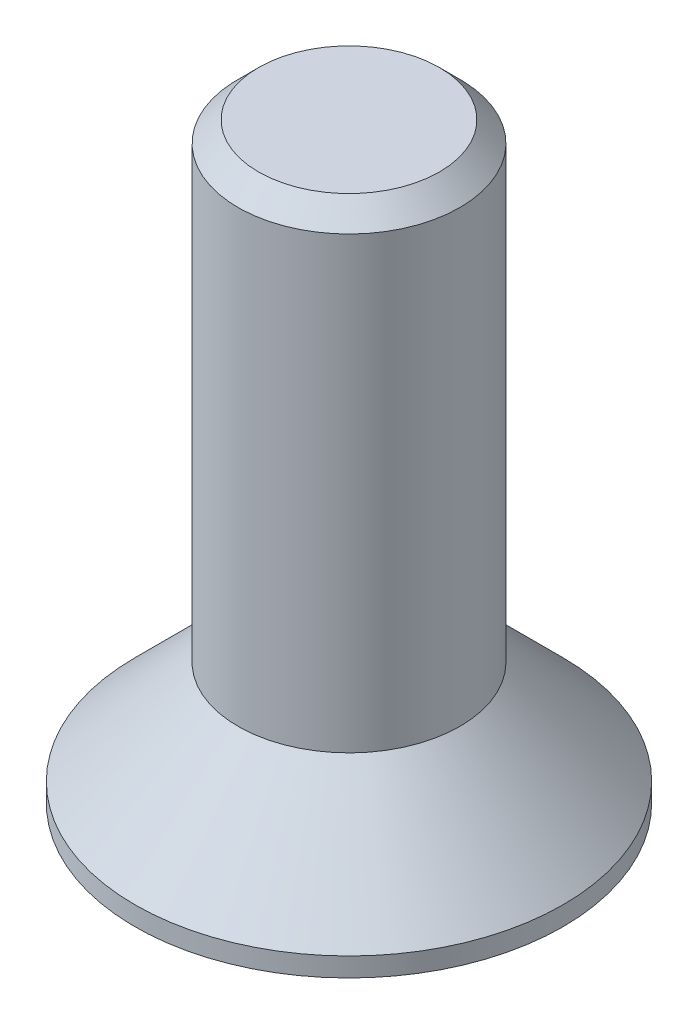
ISO-10303-21;
HEADER;
FILE_DESCRIPTION(('STEP AP214'),'2;1');
FILE_NAME('part.step','',(''),(''),'','','');
FILE_SCHEMA(('AUTOMOTIVE_DESIGN { 1 0 10303 214 1 1 1 1 }'));
ENDSEC;
DATA;
#1=APPLICATION_CONTEXT('core data for automotive mechanical design processes');
#2=APPLICATION_PROTOCOL_DEFINITION('international standard','automotive_design',2000,#1);
#3=PRODUCT_CONTEXT('',#1,'mechanical');
#4=PRODUCT('Part','Part','',(#3));
#5=PRODUCT_RELATED_PRODUCT_CATEGORY('part','',(#4));
#6=PRODUCT_DEFINITION_FORMATION('','',#4);
#7=PRODUCT_DEFINITION_CONTEXT('part definition',#1,'design');
#8=PRODUCT_DEFINITION('design','',#6,#7);
#9=PRODUCT_DEFINITION_SHAPE('','',#8);
#10=(LENGTH_UNIT() NAMED_UNIT(*) SI_UNIT(.MILLI.,.METRE.));
#11=(NAMED_UNIT(*) PLANE_ANGLE_UNIT() SI_UNIT($,.RADIAN.));
#12=(NAMED_UNIT(*) SI_UNIT($,.STERADIAN.) SOLID_ANGLE_UNIT());
#13=UNCERTAINTY_MEASURE_WITH_UNIT(LENGTH_MEASURE(1.E-05),#10,'distance_accuracy_value','');
#14=(GEOMETRIC_REPRESENTATION_CONTEXT(3) GLOBAL_UNCERTAINTY_ASSIGNED_CONTEXT((#13)) GLOBAL_UNIT_ASSIGNED_CONTEXT((#10,
#11,#12)) REPRESENTATION_CONTEXT('',''));
#15=CARTESIAN_POINT('',(0.,0.,0.));
#16=DIRECTION('',(0.,0.,1.));
#17=DIRECTION('',(1.,0.,0.));
#18=AXIS2_PLACEMENT_3D('',#15,#16,#17);
#19=CARTESIAN_POINT('',(2.32094808214229,2.50000000000001,0.));
#20=DIRECTION('',(0.,-1.,0.));
#21=DIRECTION('',(1.,0.,0.));
#22=AXIS2_PLACEMENT_3D('',#19,#20,#21);
#23=PLANE('',#22);
#24=DIRECTION('',(0.499999999999997,0.,-0.86602540378444));
#25=VECTOR('',#24,1.);
#26=CARTESIAN_POINT('',(-1.74071106160673,2.5,-1.005));
#27=LINE('',#26,#25);
#28=CARTESIAN_POINT('',(-1.74071106159993,2.50000000002728,-1.00499999999607));
#29=VERTEX_POINT('',#28);
#30=CARTESIAN_POINT('',(-1.16047404107116,2.5,-2.01));
#31=VERTEX_POINT('',#30);
#32=EDGE_CURVE('E94',#29,#31,#27,.T.);
#33=ORIENTED_EDGE('',*,*,#32,.T.);
#34=DIRECTION('',(1.,0.,0.));
#35=VECTOR('',#34,1.);
#36=CARTESIAN_POINT('',(2.32094808214229,2.50000000000001,-2.01));
#37=LINE('',#36,#35);
#38=CARTESIAN_POINT('',(0.,2.50000000002729,-2.00999999999215));
#39=VERTEX_POINT('',#38);
#40=EDGE_CURVE('E103',#31,#39,#37,.T.);
#41=ORIENTED_EDGE('',*,*,#40,.T.);
#42=CARTESIAN_POINT('',(0.,2.50000000005457,0.));
#43=DIRECTION('',(0.,-1.,0.));
#44=DIRECTION('',(1.,0.,0.));
#45=AXIS2_PLACEMENT_3D('',#42,#43,#44);
#46=CIRCLE('',#45,2.0099999999843);
#47=EDGE_CURVE('E20',#39,#29,#46,.F.);
#48=ORIENTED_EDGE('',*,*,#47,.T.);
#49=EDGE_LOOP('',(#33,#41,#48));
#50=FACE_BOUND('',#49,.T.);
#51=ADVANCED_FACE('F17',(#50),#23,.T.);
#52=CARTESIAN_POINT('',(2.32094808214229,2.50000000000001,0.));
#53=DIRECTION('',(0.,-1.,0.));
#54=DIRECTION('',(1.,0.,0.));
#55=AXIS2_PLACEMENT_3D('',#52,#53,#54);
#56=PLANE('',#55);
#57=DIRECTION('',(-0.499999999999998,0.,-0.86602540378444));
#58=VECTOR('',#57,1.);
#59=CARTESIAN_POINT('',(-1.74071106160673,2.5,1.005));
#60=LINE('',#59,#58);
#61=CARTESIAN_POINT('',(-1.74071106159993,2.50000000002728,1.00499999999608));
#62=VERTEX_POINT('',#61);
#63=CARTESIAN_POINT('',(-2.3209480821423,2.49999999999999,0.));
#64=VERTEX_POINT('',#63);
#65=EDGE_CURVE('E117',#62,#64,#60,.T.);
#66=ORIENTED_EDGE('',*,*,#65,.T.);
#67=DIRECTION('',(0.499999999999998,0.,-0.86602540378444));
#68=VECTOR('',#67,1.);
#69=CARTESIAN_POINT('',(-2.3209480821423,2.49999999999999,0.));
#70=LINE('',#69,#68);
#71=EDGE_CURVE('E98',#64,#29,#70,.T.);
#72=ORIENTED_EDGE('',*,*,#71,.T.);
#73=CARTESIAN_POINT('',(0.,2.50000000005457,0.));
#74=DIRECTION('',(0.,-1.,0.));
#75=DIRECTION('',(1.,0.,0.));
#76=AXIS2_PLACEMENT_3D('',#73,#74,#75);
#77=CIRCLE('',#76,2.0099999999843);
#78=EDGE_CURVE('E110',#29,#62,#77,.F.);
#79=ORIENTED_EDGE('',*,*,#78,.T.);
#80=EDGE_LOOP('',(#66,#72,#79));
#81=FACE_BOUND('',#80,.T.);
#82=ADVANCED_FACE('F115',(#81),#56,.T.);
#83=CARTESIAN_POINT('',(2.32094808214229,2.50000000000001,0.));
#84=DIRECTION('',(0.,-1.,0.));
#85=DIRECTION('',(1.,0.,0.));
#86=AXIS2_PLACEMENT_3D('',#83,#84,#85);
#87=PLANE('',#86);
#88=DIRECTION('',(1.,0.,0.));
#89=VECTOR('',#88,1.);
#90=CARTESIAN_POINT('',(2.32094808214229,2.50000000000001,2.01));
#91=LINE('',#90,#89);
#92=CARTESIAN_POINT('',(0.,2.50000000002729,2.00999999999215));
#93=VERTEX_POINT('',#92);
#94=CARTESIAN_POINT('',(-1.16047404107116,2.5,2.01));
#95=VERTEX_POINT('',#94);
#96=EDGE_CURVE('E118',#93,#95,#91,.F.);
#97=ORIENTED_EDGE('',*,*,#96,.T.);
#98=DIRECTION('',(-0.499999999999997,0.,-0.86602540378444));
#99=VECTOR('',#98,1.);
#100=CARTESIAN_POINT('',(-1.16047404107116,2.5,2.01));
#101=LINE('',#100,#99);
#102=EDGE_CURVE('E180',#95,#62,#101,.T.);
#103=ORIENTED_EDGE('',*,*,#102,.T.);
#104=CARTESIAN_POINT('',(0.,2.50000000005457,0.));
#105=DIRECTION('',(0.,-1.,0.));
#106=DIRECTION('',(1.,0.,0.));
#107=AXIS2_PLACEMENT_3D('',#104,#105,#106);
#108=CIRCLE('',#107,2.0099999999843);
#109=EDGE_CURVE('E125',#62,#93,#108,.F.);
#110=ORIENTED_EDGE('',*,*,#109,.T.);
#111=EDGE_LOOP('',(#97,#103,#110));
#112=FACE_BOUND('',#111,.T.);
#113=ADVANCED_FACE('F394',(#112),#87,.T.);
#114=CARTESIAN_POINT('',(2.32094808214229,2.50000000000001,0.));
#115=DIRECTION('',(0.,-1.,0.));
#116=DIRECTION('',(1.,0.,0.));
#117=AXIS2_PLACEMENT_3D('',#114,#115,#116);
#118=PLANE('',#117);
#119=DIRECTION('',(-0.499999999999997,0.,0.86602540378444));
#120=VECTOR('',#119,1.);
#121=CARTESIAN_POINT('',(1.74071106160671,2.50000000000001,1.005));
#122=LINE('',#121,#120);
#123=CARTESIAN_POINT('',(1.74071106159991,2.50000000002729,1.00499999999608));
#124=VERTEX_POINT('',#123);
#125=CARTESIAN_POINT('',(1.16047404107114,2.50000000000001,2.01));
#126=VERTEX_POINT('',#125);
#127=EDGE_CURVE('E184',#124,#126,#122,.T.);
#128=ORIENTED_EDGE('',*,*,#127,.T.);
#129=DIRECTION('',(1.,0.,0.));
#130=VECTOR('',#129,1.);
#131=CARTESIAN_POINT('',(2.32094808214229,2.50000000000001,2.01));
#132=LINE('',#131,#130);
#133=EDGE_CURVE('E189',#126,#93,#132,.F.);
#134=ORIENTED_EDGE('',*,*,#133,.T.);
#135=CARTESIAN_POINT('',(0.,2.50000000005457,0.));
#136=DIRECTION('',(0.,-1.,0.));
#137=DIRECTION('',(1.,0.,0.));
#138=AXIS2_PLACEMENT_3D('',#135,#136,#137);
#139=CIRCLE('',#138,2.0099999999843);
#140=EDGE_CURVE('E126',#93,#124,#139,.F.);
#141=ORIENTED_EDGE('',*,*,#140,.T.);
#142=EDGE_LOOP('',(#128,#134,#141));
#143=FACE_BOUND('',#142,.T.);
#144=ADVANCED_FACE('F384',(#143),#118,.T.);
#145=CARTESIAN_POINT('',(2.32094808214229,2.50000000000001,0.));
#146=DIRECTION('',(0.,-1.,0.));
#147=DIRECTION('',(1.,0.,0.));
#148=AXIS2_PLACEMENT_3D('',#145,#146,#147);
#149=PLANE('',#148);
#150=DIRECTION('',(1.,0.,0.));
#151=VECTOR('',#150,1.);
#152=CARTESIAN_POINT('',(2.32094808214229,2.50000000000001,-2.01));
#153=LINE('',#152,#151);
#154=CARTESIAN_POINT('',(1.16047404107114,2.50000000000001,-2.01));
#155=VERTEX_POINT('',#154);
#156=EDGE_CURVE('E88',#39,#155,#153,.T.);
#157=ORIENTED_EDGE('',*,*,#156,.T.);
#158=DIRECTION('',(0.499999999999997,0.,0.86602540378444));
#159=VECTOR('',#158,1.);
#160=CARTESIAN_POINT('',(1.16047404107114,2.50000000000001,-2.01));
#161=LINE('',#160,#159);
#162=CARTESIAN_POINT('',(1.74071106159991,2.50000000002729,-1.00499999999608));
#163=VERTEX_POINT('',#162);
#164=EDGE_CURVE('E111',#155,#163,#161,.T.);
#165=ORIENTED_EDGE('',*,*,#164,.T.);
#166=CARTESIAN_POINT('',(0.,2.50000000005457,0.));
#167=DIRECTION('',(0.,-1.,0.));
#168=DIRECTION('',(1.,0.,0.));
#169=AXIS2_PLACEMENT_3D('',#166,#167,#168);
#170=CIRCLE('',#169,2.0099999999843);
#171=EDGE_CURVE('E131',#163,#39,#170,.F.);
#172=ORIENTED_EDGE('',*,*,#171,.T.);
#173=EDGE_LOOP('',(#157,#165,#172));
#174=FACE_BOUND('',#173,.T.);
#175=ADVANCED_FACE('F374',(#174),#149,.T.);
#176=CARTESIAN_POINT('',(0.,2.50000000005457,0.));
#177=DIRECTION('',(0.,-1.,0.));
#178=DIRECTION('',(1.,0.,0.));
#179=AXIS2_PLACEMENT_3D('',#176,#177,#178);
#180=CONICAL_SURFACE('',#179,2.0099999999843,1.04719755119828);
#181=CARTESIAN_POINT('',(0.,3.66047404111214,0.));
#182=VERTEX_POINT('',#181);
#183=VERTEX_LOOP('',#182);
#184=FACE_BOUND('',#183,.T.);
#185=CARTESIAN_POINT('',(0.,2.50000000005457,0.));
#186=DIRECTION('',(0.,-1.,0.));
#187=DIRECTION('',(1.,0.,0.));
#188=AXIS2_PLACEMENT_3D('',#185,#186,#187);
#189=CIRCLE('',#188,2.0099999999843);
#190=EDGE_CURVE('E133',#124,#163,#189,.F.);
#191=ORIENTED_EDGE('',*,*,#190,.F.);
#192=ORIENTED_EDGE('',*,*,#140,.F.);
#193=ORIENTED_EDGE('',*,*,#109,.F.);
#194=ORIENTED_EDGE('',*,*,#78,.F.);
#195=ORIENTED_EDGE('',*,*,#47,.F.);
#196=ORIENTED_EDGE('',*,*,#171,.F.);
#197=EDGE_LOOP('',(#191,#192,#193,#194,#195,#196));
#198=FACE_BOUND('',#197,.T.);
#199=ADVANCED_FACE('F122',(#184,#198),#180,.F.);
#200=CARTESIAN_POINT('',(2.32094808214229,2.50000000000001,0.));
#201=DIRECTION('',(0.,-1.,0.));
#202=DIRECTION('',(1.,0.,0.));
#203=AXIS2_PLACEMENT_3D('',#200,#201,#202);
#204=PLANE('',#203);
#205=DIRECTION('',(0.500000000000004,0.,0.866025403784436));
#206=VECTOR('',#205,1.);
#207=CARTESIAN_POINT('',(1.74071106160671,2.50000000000001,-1.005));
#208=LINE('',#207,#206);
#209=CARTESIAN_POINT('',(2.32094808214229,2.50000000000001,0.));
#210=VERTEX_POINT('',#209);
#211=EDGE_CURVE('E136',#163,#210,#208,.T.);
#212=ORIENTED_EDGE('',*,*,#211,.T.);
#213=DIRECTION('',(-0.500000000000001,0.,0.866025403784438));
#214=VECTOR('',#213,1.);
#215=CARTESIAN_POINT('',(1.16047404107114,2.50000000000001,2.01));
#216=LINE('',#215,#214);
#217=EDGE_CURVE('E204',#124,#210,#216,.F.);
#218=ORIENTED_EDGE('',*,*,#217,.F.);
#219=ORIENTED_EDGE('',*,*,#190,.T.);
#220=EDGE_LOOP('',(#212,#218,#219));
#221=FACE_BOUND('',#220,.T.);
#222=ADVANCED_FACE('F355',(#221),#204,.T.);
#223=CARTESIAN_POINT('',(1.16047404107114,2.5,2.01));
#224=DIRECTION('',(-0.866025403784438,0.,-0.500000000000001));
#225=DIRECTION('',(-0.500000000000001,0.,0.866025403784438));
#226=AXIS2_PLACEMENT_3D('',#223,#224,#225);
#227=PLANE('',#226);
#228=ORIENTED_EDGE('',*,*,#217,.T.);
#229=DIRECTION('',(0.,1.,0.));
#230=VECTOR('',#229,1.);
#231=CARTESIAN_POINT('',(2.32094808214229,2.50000000000001,0.));
#232=LINE('',#231,#230);
#233=CARTESIAN_POINT('',(2.3209480821423,0.,0.));
#234=VERTEX_POINT('',#233);
#235=EDGE_CURVE('E165',#234,#210,#232,.T.);
#236=ORIENTED_EDGE('',*,*,#235,.F.);
#237=DIRECTION('',(0.500000000000001,0.,-0.866025403784438));
#238=VECTOR('',#237,1.);
#239=CARTESIAN_POINT('',(1.16047404107115,0.,2.01));
#240=LINE('',#239,#238);
#241=CARTESIAN_POINT('',(1.16047404107115,0.,2.01));
#242=VERTEX_POINT('',#241);
#243=EDGE_CURVE('E161',#242,#234,#240,.T.);
#244=ORIENTED_EDGE('',*,*,#243,.F.);
#245=DIRECTION('',(0.,1.,0.));
#246=VECTOR('',#245,1.);
#247=CARTESIAN_POINT('',(1.16047404107114,2.5,2.01));
#248=LINE('',#247,#246);
#249=EDGE_CURVE('E156',#126,#242,#248,.F.);
#250=ORIENTED_EDGE('',*,*,#249,.F.);
#251=ORIENTED_EDGE('',*,*,#127,.F.);
#252=EDGE_LOOP('',(#228,#236,#244,#250,#251));
#253=FACE_BOUND('',#252,.T.);
#254=ADVANCED_FACE('F345',(#253),#227,.T.);
#255=CARTESIAN_POINT('',(2.32094808214229,2.50000000000001,0.));
#256=DIRECTION('',(-0.866025403784438,0.,0.500000000000001));
#257=DIRECTION('',(0.500000000000001,0.,0.866025403784438));
#258=AXIS2_PLACEMENT_3D('',#255,#256,#257);
#259=PLANE('',#258);
#260=ORIENTED_EDGE('',*,*,#164,.F.);
#261=DIRECTION('',(0.,1.,0.));
#262=VECTOR('',#261,1.);
#263=CARTESIAN_POINT('',(1.16047404107115,2.5,-2.01));
#264=LINE('',#263,#262);
#265=CARTESIAN_POINT('',(1.16047404107115,0.,-2.01));
#266=VERTEX_POINT('',#265);
#267=EDGE_CURVE('E149',#266,#155,#264,.T.);
#268=ORIENTED_EDGE('',*,*,#267,.F.);
#269=DIRECTION('',(-0.500000000000001,0.,-0.866025403784438));
#270=VECTOR('',#269,1.);
#271=CARTESIAN_POINT('',(2.3209480821423,0.,0.));
#272=LINE('',#271,#270);
#273=EDGE_CURVE('E214',#234,#266,#272,.T.);
#274=ORIENTED_EDGE('',*,*,#273,.F.);
#275=ORIENTED_EDGE('',*,*,#235,.T.);
#276=ORIENTED_EDGE('',*,*,#211,.F.);
#277=EDGE_LOOP('',(#260,#268,#274,#275,#276));
#278=FACE_BOUND('',#277,.T.);
#279=ADVANCED_FACE('F336',(#278),#259,.T.);
#280=CARTESIAN_POINT('',(1.16047404107114,2.5,-2.01));
#281=DIRECTION('',(0.,0.,1.));
#282=DIRECTION('',(1.,0.,0.));
#283=AXIS2_PLACEMENT_3D('',#280,#281,#282);
#284=PLANE('',#283);
#285=ORIENTED_EDGE('',*,*,#40,.F.);
#286=DIRECTION('',(0.,1.,0.));
#287=VECTOR('',#286,1.);
#288=CARTESIAN_POINT('',(-1.16047404107116,2.5,-2.01));
#289=LINE('',#288,#287);
#290=CARTESIAN_POINT('',(-1.16047404107116,0.,-2.01));
#291=VERTEX_POINT('',#290);
#292=EDGE_CURVE('E101',#291,#31,#289,.T.);
#293=ORIENTED_EDGE('',*,*,#292,.F.);
#294=DIRECTION('',(1.,0.,0.));
#295=VECTOR('',#294,1.);
#296=CARTESIAN_POINT('',(0.,0.,-2.01));
#297=LINE('',#296,#295);
#298=EDGE_CURVE('E217',#266,#291,#297,.F.);
#299=ORIENTED_EDGE('',*,*,#298,.F.);
#300=ORIENTED_EDGE('',*,*,#267,.T.);
#301=ORIENTED_EDGE('',*,*,#156,.F.);
#302=EDGE_LOOP('',(#285,#293,#299,#300,#301));
#303=FACE_BOUND('',#302,.T.);
#304=ADVANCED_FACE('F327',(#303),#284,.T.);
#305=CARTESIAN_POINT('',(-1.16047404107116,2.5,-2.01));
#306=DIRECTION('',(0.866025403784439,0.,0.5));
#307=DIRECTION('',(0.5,0.,-0.866025403784439));
#308=AXIS2_PLACEMENT_3D('',#305,#306,#307);
#309=PLANE('',#308);
#310=ORIENTED_EDGE('',*,*,#71,.F.);
#311=DIRECTION('',(0.,1.,0.));
#312=VECTOR('',#311,1.);
#313=CARTESIAN_POINT('',(-2.3209480821423,2.5,0.));
#314=LINE('',#313,#312);
#315=CARTESIAN_POINT('',(-2.3209480821423,0.,0.));
#316=VERTEX_POINT('',#315);
#317=EDGE_CURVE('E148',#316,#64,#314,.T.);
#318=ORIENTED_EDGE('',*,*,#317,.F.);
#319=DIRECTION('',(-0.500000000000001,0.,0.866025403784438));
#320=VECTOR('',#319,1.);
#321=CARTESIAN_POINT('',(-1.16047404107115,0.,-2.01));
#322=LINE('',#321,#320);
#323=EDGE_CURVE('E220',#291,#316,#322,.T.);
#324=ORIENTED_EDGE('',*,*,#323,.F.);
#325=ORIENTED_EDGE('',*,*,#292,.T.);
#326=ORIENTED_EDGE('',*,*,#32,.F.);
#327=EDGE_LOOP('',(#310,#318,#324,#325,#326));
#328=FACE_BOUND('',#327,.T.);
#329=ADVANCED_FACE('F96',(#328),#309,.T.);
#330=CARTESIAN_POINT('',(-2.3209480821423,2.5,0.));
#331=DIRECTION('',(0.866025403784439,0.,-0.5));
#332=DIRECTION('',(-0.5,0.,-0.866025403784439));
#333=AXIS2_PLACEMENT_3D('',#330,#331,#332);
#334=PLANE('',#333);
#335=ORIENTED_EDGE('',*,*,#102,.F.);
#336=DIRECTION('',(0.,1.,0.));
#337=VECTOR('',#336,1.);
#338=CARTESIAN_POINT('',(-1.16047404107115,2.5,2.01));
#339=LINE('',#338,#337);
#340=CARTESIAN_POINT('',(-1.16047404107115,0.,2.01));
#341=VERTEX_POINT('',#340);
#342=EDGE_CURVE('E35',#341,#95,#339,.T.);
#343=ORIENTED_EDGE('',*,*,#342,.F.);
#344=DIRECTION('',(0.500000000000001,0.,0.866025403784438));
#345=VECTOR('',#344,1.);
#346=CARTESIAN_POINT('',(-2.3209480821423,0.,0.));
#347=LINE('',#346,#345);
#348=EDGE_CURVE('E223',#316,#341,#347,.T.);
#349=ORIENTED_EDGE('',*,*,#348,.F.);
#350=ORIENTED_EDGE('',*,*,#317,.T.);
#351=ORIENTED_EDGE('',*,*,#65,.F.);
#352=EDGE_LOOP('',(#335,#343,#349,#350,#351));
#353=FACE_BOUND('',#352,.T.);
#354=ADVANCED_FACE('F309',(#353),#334,.T.);
#355=CARTESIAN_POINT('',(-1.16047404107116,2.5,2.01));
#356=DIRECTION('',(0.,0.,-1.));
#357=DIRECTION('',(-1.,0.,0.));
#358=AXIS2_PLACEMENT_3D('',#355,#356,#357);
#359=PLANE('',#358);
#360=ORIENTED_EDGE('',*,*,#133,.F.);
#361=ORIENTED_EDGE('',*,*,#249,.T.);
#362=DIRECTION('',(1.,0.,0.));
#363=VECTOR('',#362,1.);
#364=CARTESIAN_POINT('',(0.,0.,2.01));
#365=LINE('',#364,#363);
#366=EDGE_CURVE('E141',#341,#242,#365,.T.);
#367=ORIENTED_EDGE('',*,*,#366,.F.);
#368=ORIENTED_EDGE('',*,*,#342,.T.);
#369=ORIENTED_EDGE('',*,*,#96,.F.);
#370=EDGE_LOOP('',(#360,#361,#367,#368,#369));
#371=FACE_BOUND('',#370,.T.);
#372=ADVANCED_FACE('F260',(#371),#359,.T.);
#373=CARTESIAN_POINT('',(0.,0.,0.));
#374=DIRECTION('',(0.,-1.,0.));
#375=DIRECTION('',(1.,0.,0.));
#376=AXIS2_PLACEMENT_3D('',#373,#374,#375);
#377=PLANE('',#376);
#378=ORIENTED_EDGE('',*,*,#348,.T.);
#379=ORIENTED_EDGE('',*,*,#366,.T.);
#380=ORIENTED_EDGE('',*,*,#243,.T.);
#381=ORIENTED_EDGE('',*,*,#273,.T.);
#382=ORIENTED_EDGE('',*,*,#298,.T.);
#383=ORIENTED_EDGE('',*,*,#323,.T.);
#384=EDGE_LOOP('',(#378,#379,#380,#381,#382,#383));
#385=FACE_BOUND('',#384,.T.);
#386=CARTESIAN_POINT('',(0.,0.,0.));
#387=DIRECTION('',(0.,-1.,0.));
#388=DIRECTION('',(1.,0.,0.));
#389=AXIS2_PLACEMENT_3D('',#386,#387,#388);
#390=CIRCLE('',#389,5.785);
#391=CARTESIAN_POINT('',(5.785,0.,0.));
#392=VERTEX_POINT('',#391);
#393=EDGE_CURVE('E137',#392,#392,#390,.F.);
#394=ORIENTED_EDGE('',*,*,#393,.F.);
#395=EDGE_LOOP('',(#394));
#396=FACE_BOUND('',#395,.T.);
#397=ADVANCED_FACE('F251',(#385,#396),#377,.T.);
#398=CARTESIAN_POINT('',(-2.44550000000006,16.,0.));
#399=DIRECTION('',(0.,1.,0.));
#400=DIRECTION('',(-1.,0.,0.));
#401=AXIS2_PLACEMENT_3D('',#398,#399,#400);
#402=PLANE('',#401);
#403=CARTESIAN_POINT('',(0.,16.0000000000196,0.));
#404=DIRECTION('',(0.,-1.,0.));
#405=DIRECTION('',(1.,0.,0.));
#406=AXIS2_PLACEMENT_3D('',#403,#404,#405);
#407=CIRCLE('',#406,2.4454999999648);
#408=CARTESIAN_POINT('',(2.44549999996474,16.0000000000196,0.));
#409=VERTEX_POINT('',#408);
#410=EDGE_CURVE('E140',#409,#409,#407,.T.);
#411=ORIENTED_EDGE('',*,*,#410,.F.);
#412=EDGE_LOOP('',(#411));
#413=FACE_BOUND('',#412,.T.);
#414=ADVANCED_FACE('F249',(#413),#402,.T.);
#415=CARTESIAN_POINT('',(0.,0.,0.));
#416=DIRECTION('',(0.,-1.,0.));
#417=DIRECTION('',(1.,0.,0.));
#418=AXIS2_PLACEMENT_3D('',#415,#416,#417);
#419=CYLINDRICAL_SURFACE('',#418,5.785);
#420=ORIENTED_EDGE('',*,*,#393,.T.);
#421=EDGE_LOOP('',(#420));
#422=FACE_BOUND('',#421,.T.);
#423=CARTESIAN_POINT('',(0.,0.514999999950305,0.));
#424=DIRECTION('',(0.,-1.,0.));
#425=DIRECTION('',(0.,0.,1.));
#426=AXIS2_PLACEMENT_3D('',#423,#424,#425);
#427=CIRCLE('',#426,5.78500000005988);
#428=CARTESIAN_POINT('',(0.,0.514999999950305,5.78500000005988));
#429=VERTEX_POINT('',#428);
#430=EDGE_CURVE('E144',#429,#429,#427,.F.);
#431=ORIENTED_EDGE('',*,*,#430,.F.);
#432=EDGE_LOOP('',(#431));
#433=FACE_BOUND('',#432,.T.);
#434=ADVANCED_FACE('F245',(#422,#433),#419,.T.);
#435=CARTESIAN_POINT('',(0.,15.4455000000553,0.));
#436=DIRECTION('',(0.,-1.,0.));
#437=DIRECTION('',(1.,0.,0.));
#438=AXIS2_PLACEMENT_3D('',#435,#436,#437);
#439=CONICAL_SURFACE('',#438,2.99999999992906,0.785398163397448);
#440=CARTESIAN_POINT('',(0.,15.4454999999999,0.));
#441=DIRECTION('',(0.,-1.,0.));
#442=DIRECTION('',(1.,0.,0.));
#443=AXIS2_PLACEMENT_3D('',#440,#441,#442);
#444=CIRCLE('',#443,2.99999999999996);
#445=CARTESIAN_POINT('',(2.99999999999991,15.4454999999999,0.));
#446=VERTEX_POINT('',#445);
#447=EDGE_CURVE('E26',#446,#446,#444,.T.);
#448=ORIENTED_EDGE('',*,*,#447,.F.);
#449=EDGE_LOOP('',(#448));
#450=FACE_BOUND('',#449,.T.);
#451=ORIENTED_EDGE('',*,*,#410,.T.);
#452=EDGE_LOOP('',(#451));
#453=FACE_BOUND('',#452,.T.);
#454=ADVANCED_FACE('F241',(#450,#453),#439,.T.);
#455=CARTESIAN_POINT('',(0.,0.515000000063992,0.));
#456=DIRECTION('',(0.,-1.,0.));
#457=DIRECTION('',(1.,0.,0.));
#458=AXIS2_PLACEMENT_3D('',#455,#456,#457);
#459=CONICAL_SURFACE('',#458,5.78500000000304,0.785398163407654);
#460=ORIENTED_EDGE('',*,*,#430,.T.);
#461=EDGE_LOOP('',(#460));
#462=FACE_BOUND('',#461,.T.);
#463=CARTESIAN_POINT('',(0.,3.3,0.));
#464=DIRECTION('',(0.,-1.,0.));
#465=DIRECTION('',(1.,0.,0.));
#466=AXIS2_PLACEMENT_3D('',#463,#464,#465);
#467=CIRCLE('',#466,2.99999999999996);
#468=CARTESIAN_POINT('',(2.99999999999995,3.30000000000001,0.));
#469=VERTEX_POINT('',#468);
#470=EDGE_CURVE('E11',#469,#469,#467,.F.);
#471=ORIENTED_EDGE('',*,*,#470,.F.);
#472=EDGE_LOOP('',(#471));
#473=FACE_BOUND('',#472,.T.);
#474=ADVANCED_FACE('F244',(#462,#473),#459,.T.);
#475=CARTESIAN_POINT('',(0.,0.,0.));
#476=DIRECTION('',(0.,-1.,0.));
#477=DIRECTION('',(1.,0.,0.));
#478=AXIS2_PLACEMENT_3D('',#475,#476,#477);
#479=CYLINDRICAL_SURFACE('',#478,2.99999999999996);
#480=ORIENTED_EDGE('',*,*,#470,.T.);
#481=EDGE_LOOP('',(#480));
#482=FACE_BOUND('',#481,.T.);
#483=ORIENTED_EDGE('',*,*,#447,.T.);
#484=EDGE_LOOP('',(#483));
#485=FACE_BOUND('',#484,.T.);
#486=ADVANCED_FACE('F239',(#482,#485),#479,.T.);
#487=CLOSED_SHELL('',(#51,#82,#113,#144,#175,#199,#222,#254,#279,#304,#329,#354,#372,#397,#414,
#434,#454,#474,#486));
#488=MANIFOLD_SOLID_BREP('B1',#487);
#489=ADVANCED_BREP_SHAPE_REPRESENTATION('',(#18,#488),#14);
#490=SHAPE_DEFINITION_REPRESENTATION(#9,#489);
ENDSEC;
END-ISO-10303-21;
